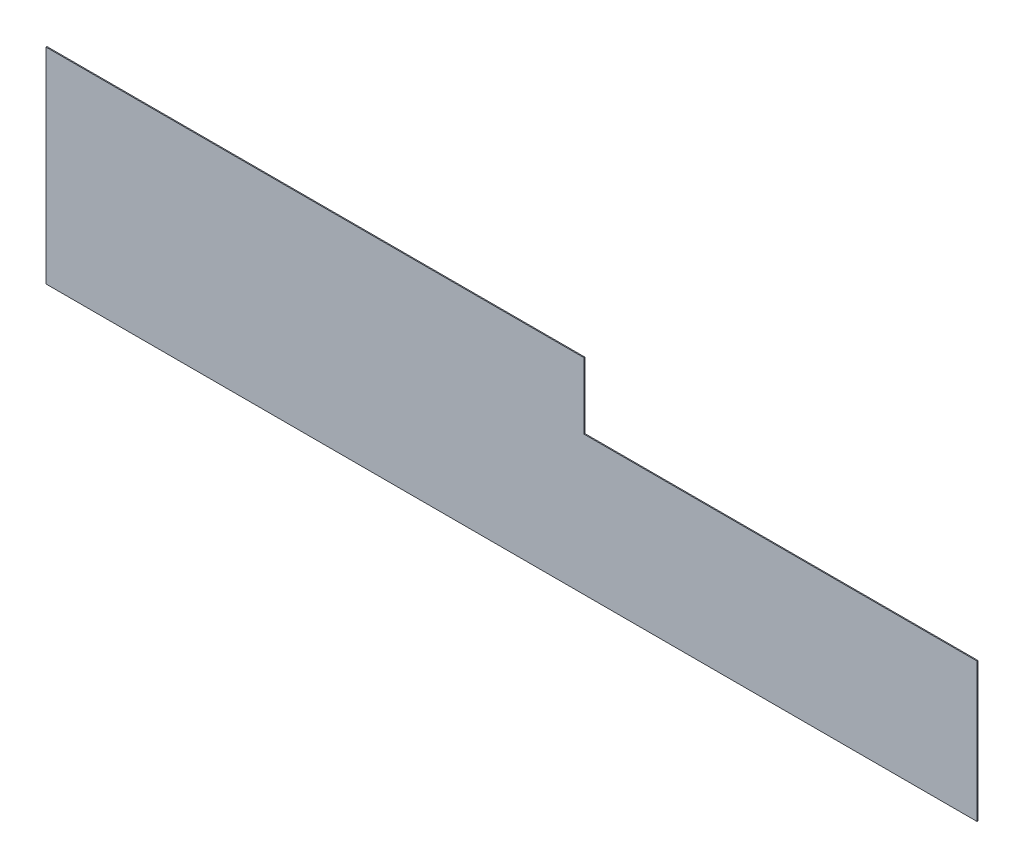
ISO-10303-21;
HEADER;
FILE_DESCRIPTION(('STEP AP214'),'2;1');
FILE_NAME('part.step','',(''),(''),'','','');
FILE_SCHEMA(('AUTOMOTIVE_DESIGN { 1 0 10303 214 1 1 1 1 }'));
ENDSEC;
DATA;
#1=APPLICATION_CONTEXT('core data for automotive mechanical design processes');
#2=APPLICATION_PROTOCOL_DEFINITION('international standard','automotive_design',2000,#1);
#3=PRODUCT_CONTEXT('',#1,'mechanical');
#4=PRODUCT('Part','Part','',(#3));
#5=PRODUCT_RELATED_PRODUCT_CATEGORY('part','',(#4));
#6=PRODUCT_DEFINITION_FORMATION('','',#4);
#7=PRODUCT_DEFINITION_CONTEXT('part definition',#1,'design');
#8=PRODUCT_DEFINITION('design','',#6,#7);
#9=PRODUCT_DEFINITION_SHAPE('','',#8);
#10=(LENGTH_UNIT() NAMED_UNIT(*) SI_UNIT(.MILLI.,.METRE.));
#11=(NAMED_UNIT(*) PLANE_ANGLE_UNIT() SI_UNIT($,.RADIAN.));
#12=(NAMED_UNIT(*) SI_UNIT($,.STERADIAN.) SOLID_ANGLE_UNIT());
#13=UNCERTAINTY_MEASURE_WITH_UNIT(LENGTH_MEASURE(1.E-05),#10,'distance_accuracy_value','');
#14=(GEOMETRIC_REPRESENTATION_CONTEXT(3) GLOBAL_UNCERTAINTY_ASSIGNED_CONTEXT((#13)) GLOBAL_UNIT_ASSIGNED_CONTEXT((#10,
#11,#12)) REPRESENTATION_CONTEXT('',''));
#15=CARTESIAN_POINT('',(0.,0.,0.));
#16=DIRECTION('',(0.,0.,1.));
#17=DIRECTION('',(1.,0.,0.));
#18=AXIS2_PLACEMENT_3D('',#15,#16,#17);
#19=CARTESIAN_POINT('',(5695.,-2.79062878280622E-13,-6.));
#20=DIRECTION('',(0.,-1.,0.));
#21=DIRECTION('',(1.,0.,0.));
#22=AXIS2_PLACEMENT_3D('',#19,#20,#21);
#23=PLANE('',#22);
#24=DIRECTION('',(1.,0.,0.));
#25=VECTOR('',#24,1.);
#26=CARTESIAN_POINT('',(5695.,-2.79062878280622E-13,0.));
#27=LINE('',#26,#25);
#28=CARTESIAN_POINT('',(0.,0.,0.));
#29=VERTEX_POINT('',#28);
#30=CARTESIAN_POINT('',(5695.,-2.79062878280622E-13,0.));
#31=VERTEX_POINT('',#30);
#32=EDGE_CURVE('E122',#29,#31,#27,.T.);
#33=ORIENTED_EDGE('',*,*,#32,.F.);
#34=DIRECTION('',(0.,0.,1.));
#35=VECTOR('',#34,1.);
#36=CARTESIAN_POINT('',(0.,0.,-6.));
#37=LINE('',#36,#35);
#38=CARTESIAN_POINT('',(0.,0.,-6.));
#39=VERTEX_POINT('',#38);
#40=EDGE_CURVE('E11',#39,#29,#37,.T.);
#41=ORIENTED_EDGE('',*,*,#40,.F.);
#42=DIRECTION('',(1.,0.,0.));
#43=VECTOR('',#42,1.);
#44=CARTESIAN_POINT('',(5695.,-2.79062878280622E-13,-6.));
#45=LINE('',#44,#43);
#46=CARTESIAN_POINT('',(5695.,-2.79062878280622E-13,-6.));
#47=VERTEX_POINT('',#46);
#48=EDGE_CURVE('E136',#39,#47,#45,.T.);
#49=ORIENTED_EDGE('',*,*,#48,.T.);
#50=DIRECTION('',(0.,0.,1.));
#51=VECTOR('',#50,1.);
#52=CARTESIAN_POINT('',(5695.,-2.79062878280622E-13,-6.));
#53=LINE('',#52,#51);
#54=EDGE_CURVE('E40',#47,#31,#53,.T.);
#55=ORIENTED_EDGE('',*,*,#54,.T.);
#56=EDGE_LOOP('',(#33,#41,#49,#55));
#57=FACE_BOUND('',#56,.T.);
#58=ADVANCED_FACE('F37',(#57),#23,.T.);
#59=CARTESIAN_POINT('',(0.,0.,-6.));
#60=DIRECTION('',(-1.,0.,0.));
#61=DIRECTION('',(0.,-1.,0.));
#62=AXIS2_PLACEMENT_3D('',#59,#60,#61);
#63=PLANE('',#62);
#64=DIRECTION('',(0.,-1.,0.));
#65=VECTOR('',#64,1.);
#66=CARTESIAN_POINT('',(0.,0.,0.));
#67=LINE('',#66,#65);
#68=CARTESIAN_POINT('',(4.44089209850063E-13,1255.,0.));
#69=VERTEX_POINT('',#68);
#70=EDGE_CURVE('E134',#69,#29,#67,.T.);
#71=ORIENTED_EDGE('',*,*,#70,.F.);
#72=DIRECTION('',(0.,0.,1.));
#73=VECTOR('',#72,1.);
#74=CARTESIAN_POINT('',(4.44089209850063E-13,1255.,-6.));
#75=LINE('',#74,#73);
#76=CARTESIAN_POINT('',(4.44089209850063E-13,1255.,-6.));
#77=VERTEX_POINT('',#76);
#78=EDGE_CURVE('E46',#77,#69,#75,.T.);
#79=ORIENTED_EDGE('',*,*,#78,.F.);
#80=DIRECTION('',(0.,-1.,0.));
#81=VECTOR('',#80,1.);
#82=CARTESIAN_POINT('',(0.,0.,-6.));
#83=LINE('',#82,#81);
#84=EDGE_CURVE('E112',#77,#39,#83,.T.);
#85=ORIENTED_EDGE('',*,*,#84,.T.);
#86=ORIENTED_EDGE('',*,*,#40,.T.);
#87=EDGE_LOOP('',(#71,#79,#85,#86));
#88=FACE_BOUND('',#87,.T.);
#89=ADVANCED_FACE('F144',(#88),#63,.T.);
#90=CARTESIAN_POINT('',(4.44089209850063E-13,1255.,-6.));
#91=DIRECTION('',(0.,1.,0.));
#92=DIRECTION('',(0.,0.,1.));
#93=AXIS2_PLACEMENT_3D('',#90,#91,#92);
#94=PLANE('',#93);
#95=DIRECTION('',(-1.,0.,0.));
#96=VECTOR('',#95,1.);
#97=CARTESIAN_POINT('',(4.44089209850063E-13,1255.,0.));
#98=LINE('',#97,#96);
#99=CARTESIAN_POINT('',(3290.,1255.,0.));
#100=VERTEX_POINT('',#99);
#101=EDGE_CURVE('E99',#100,#69,#98,.T.);
#102=ORIENTED_EDGE('',*,*,#101,.F.);
#103=DIRECTION('',(0.,0.,1.));
#104=VECTOR('',#103,1.);
#105=CARTESIAN_POINT('',(3290.,1255.,-6.));
#106=LINE('',#105,#104);
#107=CARTESIAN_POINT('',(3290.,1255.,-6.));
#108=VERTEX_POINT('',#107);
#109=EDGE_CURVE('E94',#108,#100,#106,.T.);
#110=ORIENTED_EDGE('',*,*,#109,.F.);
#111=DIRECTION('',(-1.,0.,0.));
#112=VECTOR('',#111,1.);
#113=CARTESIAN_POINT('',(4.44089209850063E-13,1255.,-6.));
#114=LINE('',#113,#112);
#115=EDGE_CURVE('E97',#108,#77,#114,.T.);
#116=ORIENTED_EDGE('',*,*,#115,.T.);
#117=ORIENTED_EDGE('',*,*,#78,.T.);
#118=EDGE_LOOP('',(#102,#110,#116,#117));
#119=FACE_BOUND('',#118,.T.);
#120=ADVANCED_FACE('F96',(#119),#94,.T.);
#121=CARTESIAN_POINT('',(3290.,1255.,-6.));
#122=DIRECTION('',(1.,0.,0.));
#123=DIRECTION('',(0.,0.,-1.));
#124=AXIS2_PLACEMENT_3D('',#121,#122,#123);
#125=PLANE('',#124);
#126=DIRECTION('',(0.,1.,0.));
#127=VECTOR('',#126,1.);
#128=CARTESIAN_POINT('',(3290.,1255.,0.));
#129=LINE('',#128,#127);
#130=CARTESIAN_POINT('',(3290.,850.,0.));
#131=VERTEX_POINT('',#130);
#132=EDGE_CURVE('E131',#131,#100,#129,.T.);
#133=ORIENTED_EDGE('',*,*,#132,.F.);
#134=DIRECTION('',(0.,0.,1.));
#135=VECTOR('',#134,1.);
#136=CARTESIAN_POINT('',(3290.,850.,-6.));
#137=LINE('',#136,#135);
#138=CARTESIAN_POINT('',(3290.,850.,-6.));
#139=VERTEX_POINT('',#138);
#140=EDGE_CURVE('E104',#139,#131,#137,.T.);
#141=ORIENTED_EDGE('',*,*,#140,.F.);
#142=DIRECTION('',(0.,1.,0.));
#143=VECTOR('',#142,1.);
#144=CARTESIAN_POINT('',(3290.,1255.,-6.));
#145=LINE('',#144,#143);
#146=EDGE_CURVE('E110',#139,#108,#145,.T.);
#147=ORIENTED_EDGE('',*,*,#146,.T.);
#148=ORIENTED_EDGE('',*,*,#109,.T.);
#149=EDGE_LOOP('',(#133,#141,#147,#148));
#150=FACE_BOUND('',#149,.T.);
#151=ADVANCED_FACE('F114',(#150),#125,.T.);
#152=CARTESIAN_POINT('',(3290.,850.,-6.));
#153=DIRECTION('',(0.,1.,0.));
#154=DIRECTION('',(0.,0.,1.));
#155=AXIS2_PLACEMENT_3D('',#152,#153,#154);
#156=PLANE('',#155);
#157=DIRECTION('',(-1.,0.,0.));
#158=VECTOR('',#157,1.);
#159=CARTESIAN_POINT('',(3290.,850.,0.));
#160=LINE('',#159,#158);
#161=CARTESIAN_POINT('',(5695.,850.,0.));
#162=VERTEX_POINT('',#161);
#163=EDGE_CURVE('E128',#162,#131,#160,.T.);
#164=ORIENTED_EDGE('',*,*,#163,.F.);
#165=DIRECTION('',(0.,0.,1.));
#166=VECTOR('',#165,1.);
#167=CARTESIAN_POINT('',(5695.,850.,-6.));
#168=LINE('',#167,#166);
#169=CARTESIAN_POINT('',(5695.,850.,-6.));
#170=VERTEX_POINT('',#169);
#171=EDGE_CURVE('E139',#170,#162,#168,.T.);
#172=ORIENTED_EDGE('',*,*,#171,.F.);
#173=DIRECTION('',(-1.,0.,0.));
#174=VECTOR('',#173,1.);
#175=CARTESIAN_POINT('',(3290.,850.,-6.));
#176=LINE('',#175,#174);
#177=EDGE_CURVE('E115',#170,#139,#176,.T.);
#178=ORIENTED_EDGE('',*,*,#177,.T.);
#179=ORIENTED_EDGE('',*,*,#140,.T.);
#180=EDGE_LOOP('',(#164,#172,#178,#179));
#181=FACE_BOUND('',#180,.T.);
#182=ADVANCED_FACE('F157',(#181),#156,.T.);
#183=CARTESIAN_POINT('',(5695.,850.,-6.));
#184=DIRECTION('',(1.,0.,0.));
#185=DIRECTION('',(0.,0.,-1.));
#186=AXIS2_PLACEMENT_3D('',#183,#184,#185);
#187=PLANE('',#186);
#188=DIRECTION('',(0.,1.,0.));
#189=VECTOR('',#188,1.);
#190=CARTESIAN_POINT('',(5695.,850.,0.));
#191=LINE('',#190,#189);
#192=EDGE_CURVE('E125',#31,#162,#191,.T.);
#193=ORIENTED_EDGE('',*,*,#192,.F.);
#194=ORIENTED_EDGE('',*,*,#54,.F.);
#195=DIRECTION('',(0.,1.,0.));
#196=VECTOR('',#195,1.);
#197=CARTESIAN_POINT('',(5695.,850.,-6.));
#198=LINE('',#197,#196);
#199=EDGE_CURVE('E117',#47,#170,#198,.T.);
#200=ORIENTED_EDGE('',*,*,#199,.T.);
#201=ORIENTED_EDGE('',*,*,#171,.T.);
#202=EDGE_LOOP('',(#193,#194,#200,#201));
#203=FACE_BOUND('',#202,.T.);
#204=ADVANCED_FACE('F141',(#203),#187,.T.);
#205=CARTESIAN_POINT('',(0.,0.,-6.));
#206=DIRECTION('',(0.,0.,-1.));
#207=DIRECTION('',(-1.,0.,0.));
#208=AXIS2_PLACEMENT_3D('',#205,#206,#207);
#209=PLANE('',#208);
#210=ORIENTED_EDGE('',*,*,#48,.F.);
#211=ORIENTED_EDGE('',*,*,#84,.F.);
#212=ORIENTED_EDGE('',*,*,#115,.F.);
#213=ORIENTED_EDGE('',*,*,#146,.F.);
#214=ORIENTED_EDGE('',*,*,#177,.F.);
#215=ORIENTED_EDGE('',*,*,#199,.F.);
#216=EDGE_LOOP('',(#210,#211,#212,#213,#214,#215));
#217=FACE_BOUND('',#216,.T.);
#218=ADVANCED_FACE('F108',(#217),#209,.T.);
#219=CARTESIAN_POINT('',(0.,0.,0.));
#220=DIRECTION('',(0.,0.,-1.));
#221=DIRECTION('',(-1.,0.,0.));
#222=AXIS2_PLACEMENT_3D('',#219,#220,#221);
#223=PLANE('',#222);
#224=ORIENTED_EDGE('',*,*,#32,.T.);
#225=ORIENTED_EDGE('',*,*,#192,.T.);
#226=ORIENTED_EDGE('',*,*,#163,.T.);
#227=ORIENTED_EDGE('',*,*,#132,.T.);
#228=ORIENTED_EDGE('',*,*,#101,.T.);
#229=ORIENTED_EDGE('',*,*,#70,.T.);
#230=EDGE_LOOP('',(#224,#225,#226,#227,#228,#229));
#231=FACE_BOUND('',#230,.T.);
#232=ADVANCED_FACE('F143',(#231),#223,.F.);
#233=CLOSED_SHELL('',(#58,#89,#120,#151,#182,#204,#218,#232));
#234=MANIFOLD_SOLID_BREP('B2',#233);
#235=ADVANCED_BREP_SHAPE_REPRESENTATION('',(#18,#234),#14);
#236=SHAPE_DEFINITION_REPRESENTATION(#9,#235);
ENDSEC;
END-ISO-10303-21;
